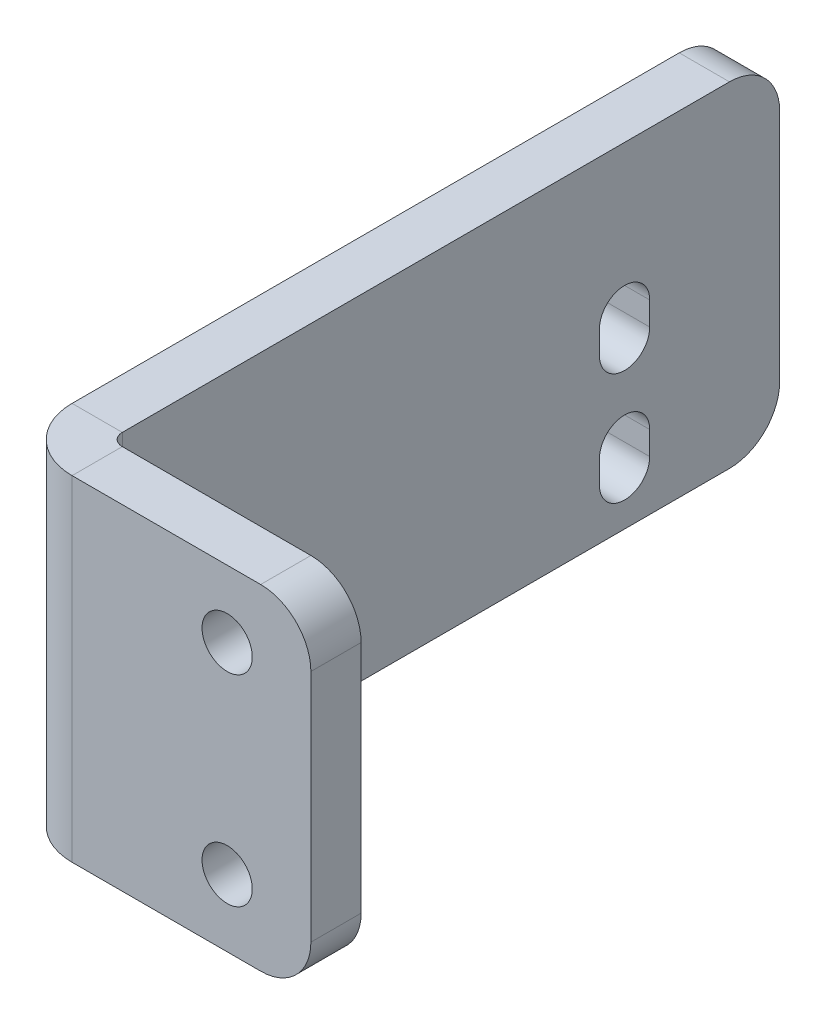
ISO-10303-21;
HEADER;
FILE_DESCRIPTION(('STEP AP214'),'2;1');
FILE_NAME('part.step','',(''),(''),'','','');
FILE_SCHEMA(('AUTOMOTIVE_DESIGN { 1 0 10303 214 1 1 1 1 }'));
ENDSEC;
DATA;
#1=APPLICATION_CONTEXT('core data for automotive mechanical design processes');
#2=APPLICATION_PROTOCOL_DEFINITION('international standard','automotive_design',2000,#1);
#3=PRODUCT_CONTEXT('',#1,'mechanical');
#4=PRODUCT('Part','Part','',(#3));
#5=PRODUCT_RELATED_PRODUCT_CATEGORY('part','',(#4));
#6=PRODUCT_DEFINITION_FORMATION('','',#4);
#7=PRODUCT_DEFINITION_CONTEXT('part definition',#1,'design');
#8=PRODUCT_DEFINITION('design','',#6,#7);
#9=PRODUCT_DEFINITION_SHAPE('','',#8);
#10=(LENGTH_UNIT() NAMED_UNIT(*) SI_UNIT(.MILLI.,.METRE.));
#11=(NAMED_UNIT(*) PLANE_ANGLE_UNIT() SI_UNIT($,.RADIAN.));
#12=(NAMED_UNIT(*) SI_UNIT($,.STERADIAN.) SOLID_ANGLE_UNIT());
#13=UNCERTAINTY_MEASURE_WITH_UNIT(LENGTH_MEASURE(1.E-05),#10,'distance_accuracy_value','');
#14=(GEOMETRIC_REPRESENTATION_CONTEXT(3) GLOBAL_UNCERTAINTY_ASSIGNED_CONTEXT((#13)) GLOBAL_UNIT_ASSIGNED_CONTEXT((#10,
#11,#12)) REPRESENTATION_CONTEXT('',''));
#15=CARTESIAN_POINT('',(0.,0.,0.));
#16=DIRECTION('',(0.,0.,1.));
#17=DIRECTION('',(1.,0.,0.));
#18=AXIS2_PLACEMENT_3D('',#15,#16,#17);
#19=CARTESIAN_POINT('',(-8.60341094882224,20.,-40.3325438161353));
#20=DIRECTION('',(0.,1.,0.));
#21=DIRECTION('',(0.,0.,1.));
#22=AXIS2_PLACEMENT_3D('',#19,#20,#21);
#23=PLANE('',#22);
#24=DIRECTION('',(0.,0.,1.));
#25=VECTOR('',#24,1.);
#26=CARTESIAN_POINT('',(-8.60341094882224,20.,-40.3325438161353));
#27=LINE('',#26,#25);
#28=CARTESIAN_POINT('',(-8.60341094882224,20.,-40.3325438161353));
#29=VERTEX_POINT('',#28);
#30=CARTESIAN_POINT('',(-8.60341094882224,20.,-37.3325438161353));
#31=VERTEX_POINT('',#30);
#32=EDGE_CURVE('E316',#29,#31,#27,.T.);
#33=ORIENTED_EDGE('',*,*,#32,.F.);
#34=CARTESIAN_POINT('',(-8.60341094882224,20.,-41.0691438161353));
#35=DIRECTION('',(0.,-1.,0.));
#36=DIRECTION('',(0.,0.,-1.));
#37=AXIS2_PLACEMENT_3D('',#34,#35,#36);
#38=CIRCLE('',#37,0.7366);
#39=CARTESIAN_POINT('',(-9.34001094882224,20.,-41.0691438161353));
#40=VERTEX_POINT('',#39);
#41=EDGE_CURVE('E260',#40,#29,#38,.F.);
#42=ORIENTED_EDGE('',*,*,#41,.F.);
#43=DIRECTION('',(1.,0.,0.));
#44=VECTOR('',#43,1.);
#45=CARTESIAN_POINT('',(-12.3400109488222,20.,-41.0691438161353));
#46=LINE('',#45,#44);
#47=CARTESIAN_POINT('',(-12.3400109488222,20.,-41.0691438161353));
#48=VERTEX_POINT('',#47);
#49=EDGE_CURVE('E313',#48,#40,#46,.T.);
#50=ORIENTED_EDGE('',*,*,#49,.F.);
#51=CARTESIAN_POINT('',(-8.60341094882224,20.,-41.0691438161353));
#52=DIRECTION('',(0.,1.,0.));
#53=DIRECTION('',(1.,0.,0.));
#54=AXIS2_PLACEMENT_3D('',#51,#52,#53);
#55=CIRCLE('',#54,3.7366);
#56=EDGE_CURVE('E267',#48,#31,#55,.T.);
#57=ORIENTED_EDGE('',*,*,#56,.T.);
#58=EDGE_LOOP('',(#33,#42,#50,#57));
#59=FACE_BOUND('',#58,.T.);
#60=ADVANCED_FACE('F36',(#59),#23,.T.);
#61=CARTESIAN_POINT('',(-12.3400109488222,20.,-41.0691438161353));
#62=DIRECTION('',(0.,1.,0.));
#63=DIRECTION('',(0.,0.,1.));
#64=AXIS2_PLACEMENT_3D('',#61,#62,#63);
#65=PLANE('',#64);
#66=DIRECTION('',(1.,0.,0.));
#67=VECTOR('',#66,1.);
#68=CARTESIAN_POINT('',(-9.34001094882224,20.,-37.3325438161353));
#69=LINE('',#68,#67);
#70=CARTESIAN_POINT('',(2.65998905117776,20.,-37.3325438161353));
#71=VERTEX_POINT('',#70);
#72=EDGE_CURVE('E253',#31,#71,#69,.T.);
#73=ORIENTED_EDGE('',*,*,#72,.T.);
#74=DIRECTION('',(0.,0.,1.));
#75=VECTOR('',#74,1.);
#76=CARTESIAN_POINT('',(2.65998905117776,20.,-41.0691438161353));
#77=LINE('',#76,#75);
#78=CARTESIAN_POINT('',(2.65998905117776,20.,-40.3325438161353));
#79=VERTEX_POINT('',#78);
#80=EDGE_CURVE('E327',#71,#79,#77,.F.);
#81=ORIENTED_EDGE('',*,*,#80,.T.);
#82=DIRECTION('',(1.,0.,0.));
#83=VECTOR('',#82,1.);
#84=CARTESIAN_POINT('',(-9.34001094882224,20.,-40.3325438161353));
#85=LINE('',#84,#83);
#86=EDGE_CURVE('E256',#29,#79,#85,.T.);
#87=ORIENTED_EDGE('',*,*,#86,.F.);
#88=ORIENTED_EDGE('',*,*,#32,.T.);
#89=EDGE_LOOP('',(#73,#81,#87,#88));
#90=FACE_BOUND('',#89,.T.);
#91=ADVANCED_FACE('F391',(#90),#65,.T.);
#92=CARTESIAN_POINT('',(-9.34001094882224,0.,-41.0691438161353));
#93=DIRECTION('',(0.,-1.,0.));
#94=DIRECTION('',(0.,0.,-1.));
#95=AXIS2_PLACEMENT_3D('',#92,#93,#94);
#96=PLANE('',#95);
#97=DIRECTION('',(-1.,0.,0.));
#98=VECTOR('',#97,1.);
#99=CARTESIAN_POINT('',(-9.34001094882224,0.,-41.0691438161353));
#100=LINE('',#99,#98);
#101=CARTESIAN_POINT('',(-9.34001094882224,0.,-41.0691438161353));
#102=VERTEX_POINT('',#101);
#103=CARTESIAN_POINT('',(-12.3400109488222,0.,-41.0691438161353));
#104=VERTEX_POINT('',#103);
#105=EDGE_CURVE('E310',#102,#104,#100,.T.);
#106=ORIENTED_EDGE('',*,*,#105,.F.);
#107=CARTESIAN_POINT('',(-8.60341094882224,0.,-41.0691438161353));
#108=DIRECTION('',(0.,-1.,0.));
#109=DIRECTION('',(0.,0.,-1.));
#110=AXIS2_PLACEMENT_3D('',#107,#108,#109);
#111=CIRCLE('',#110,0.7366);
#112=CARTESIAN_POINT('',(-8.60341094882224,0.,-40.3325438161353));
#113=VERTEX_POINT('',#112);
#114=EDGE_CURVE('E276',#102,#113,#111,.F.);
#115=ORIENTED_EDGE('',*,*,#114,.T.);
#116=DIRECTION('',(0.,0.,-1.));
#117=VECTOR('',#116,1.);
#118=CARTESIAN_POINT('',(-8.60341094882224,0.,-37.3325438161353));
#119=LINE('',#118,#117);
#120=CARTESIAN_POINT('',(-8.60341094882224,0.,-37.3325438161353));
#121=VERTEX_POINT('',#120);
#122=EDGE_CURVE('E308',#121,#113,#119,.T.);
#123=ORIENTED_EDGE('',*,*,#122,.F.);
#124=CARTESIAN_POINT('',(-8.60341094882224,0.,-41.0691438161353));
#125=DIRECTION('',(0.,1.,0.));
#126=DIRECTION('',(1.,0.,0.));
#127=AXIS2_PLACEMENT_3D('',#124,#125,#126);
#128=CIRCLE('',#127,3.7366);
#129=EDGE_CURVE('E257',#104,#121,#128,.T.);
#130=ORIENTED_EDGE('',*,*,#129,.F.);
#131=EDGE_LOOP('',(#106,#115,#123,#130));
#132=FACE_BOUND('',#131,.T.);
#133=ADVANCED_FACE('F411',(#132),#96,.T.);
#134=CARTESIAN_POINT('',(-8.60341094882224,0.,-37.3325438161353));
#135=DIRECTION('',(0.,-1.,0.));
#136=DIRECTION('',(0.,0.,-1.));
#137=AXIS2_PLACEMENT_3D('',#134,#135,#136);
#138=PLANE('',#137);
#139=DIRECTION('',(0.,0.,1.));
#140=VECTOR('',#139,1.);
#141=CARTESIAN_POINT('',(-12.3400109488222,0.,-80.3325438161353));
#142=LINE('',#141,#140);
#143=CARTESIAN_POINT('',(-12.3400109488222,0.,-77.3325438161353));
#144=VERTEX_POINT('',#143);
#145=EDGE_CURVE('E281',#144,#104,#142,.T.);
#146=ORIENTED_EDGE('',*,*,#145,.F.);
#147=DIRECTION('',(1.,0.,0.));
#148=VECTOR('',#147,1.);
#149=CARTESIAN_POINT('',(-8.60341094882224,0.,-77.3325438161353));
#150=LINE('',#149,#148);
#151=CARTESIAN_POINT('',(-9.34001094882224,0.,-77.3325438161353));
#152=VERTEX_POINT('',#151);
#153=EDGE_CURVE('E336',#144,#152,#150,.T.);
#154=ORIENTED_EDGE('',*,*,#153,.T.);
#155=DIRECTION('',(0.,0.,1.));
#156=VECTOR('',#155,1.);
#157=CARTESIAN_POINT('',(-9.34001094882224,0.,-80.3325438161353));
#158=LINE('',#157,#156);
#159=EDGE_CURVE('E279',#152,#102,#158,.T.);
#160=ORIENTED_EDGE('',*,*,#159,.T.);
#161=ORIENTED_EDGE('',*,*,#105,.T.);
#162=EDGE_LOOP('',(#146,#154,#160,#161));
#163=FACE_BOUND('',#162,.T.);
#164=ADVANCED_FACE('F358',(#163),#138,.T.);
#165=CARTESIAN_POINT('',(-9.34001094882224,20.,-37.3325438161353));
#166=DIRECTION('',(0.,0.,-1.));
#167=DIRECTION('',(-1.,0.,0.));
#168=AXIS2_PLACEMENT_3D('',#165,#166,#167);
#169=PLANE('',#168);
#170=CARTESIAN_POINT('',(0.65998905117776,4.,-37.3325438161353));
#171=DIRECTION('',(0.,0.,-1.));
#172=DIRECTION('',(-1.,0.,0.));
#173=AXIS2_PLACEMENT_3D('',#170,#171,#172);
#174=CIRCLE('',#173,1.5);
#175=CARTESIAN_POINT('',(-0.840010948822244,4.,-37.3325438161353));
#176=VERTEX_POINT('',#175);
#177=EDGE_CURVE('E243',#176,#176,#174,.F.);
#178=ORIENTED_EDGE('',*,*,#177,.F.);
#179=EDGE_LOOP('',(#178));
#180=FACE_BOUND('',#179,.T.);
#181=CARTESIAN_POINT('',(0.65998905117776,16.,-37.3325438161353));
#182=DIRECTION('',(0.,0.,-1.));
#183=DIRECTION('',(-1.,0.,0.));
#184=AXIS2_PLACEMENT_3D('',#181,#182,#183);
#185=CIRCLE('',#184,1.5);
#186=CARTESIAN_POINT('',(-0.840010948822244,16.,-37.3325438161353));
#187=VERTEX_POINT('',#186);
#188=EDGE_CURVE('E249',#187,#187,#185,.F.);
#189=ORIENTED_EDGE('',*,*,#188,.F.);
#190=EDGE_LOOP('',(#189));
#191=FACE_BOUND('',#190,.T.);
#192=DIRECTION('',(0.,-1.,0.));
#193=VECTOR('',#192,1.);
#194=CARTESIAN_POINT('',(5.65998905117776,20.,-37.3325438161353));
#195=LINE('',#194,#193);
#196=CARTESIAN_POINT('',(5.65998905117776,17.,-37.3325438161353));
#197=VERTEX_POINT('',#196);
#198=CARTESIAN_POINT('',(5.65998905117776,3.,-37.3325438161353));
#199=VERTEX_POINT('',#198);
#200=EDGE_CURVE('E305',#197,#199,#195,.T.);
#201=ORIENTED_EDGE('',*,*,#200,.F.);
#202=CARTESIAN_POINT('',(2.65998905117776,17.,-37.3325438161353));
#203=DIRECTION('',(0.,0.,-1.));
#204=DIRECTION('',(-1.,0.,0.));
#205=AXIS2_PLACEMENT_3D('',#202,#203,#204);
#206=CIRCLE('',#205,3.);
#207=EDGE_CURVE('E325',#197,#71,#206,.F.);
#208=ORIENTED_EDGE('',*,*,#207,.T.);
#209=ORIENTED_EDGE('',*,*,#72,.F.);
#210=DIRECTION('',(0.,-1.,0.));
#211=VECTOR('',#210,1.);
#212=CARTESIAN_POINT('',(-8.60341094882224,20.,-37.3325438161353));
#213=LINE('',#212,#211);
#214=EDGE_CURVE('E270',#31,#121,#213,.T.);
#215=ORIENTED_EDGE('',*,*,#214,.T.);
#216=DIRECTION('',(1.,0.,0.));
#217=VECTOR('',#216,1.);
#218=CARTESIAN_POINT('',(-9.34001094882224,0.,-37.3325438161353));
#219=LINE('',#218,#217);
#220=CARTESIAN_POINT('',(2.65998905117776,0.,-37.3325438161353));
#221=VERTEX_POINT('',#220);
#222=EDGE_CURVE('E252',#121,#221,#219,.T.);
#223=ORIENTED_EDGE('',*,*,#222,.T.);
#224=CARTESIAN_POINT('',(2.65998905117776,3.,-37.3325438161353));
#225=DIRECTION('',(0.,0.,-1.));
#226=DIRECTION('',(-1.,0.,0.));
#227=AXIS2_PLACEMENT_3D('',#224,#225,#226);
#228=CIRCLE('',#227,3.);
#229=EDGE_CURVE('E323',#221,#199,#228,.F.);
#230=ORIENTED_EDGE('',*,*,#229,.T.);
#231=EDGE_LOOP('',(#201,#208,#209,#215,#223,#230));
#232=FACE_BOUND('',#231,.T.);
#233=ADVANCED_FACE('F415',(#180,#191,#232),#169,.F.);
#234=CARTESIAN_POINT('',(5.65998905117776,20.,-40.3325438161353));
#235=DIRECTION('',(1.,0.,0.));
#236=DIRECTION('',(0.,0.,-1.));
#237=AXIS2_PLACEMENT_3D('',#234,#235,#236);
#238=PLANE('',#237);
#239=DIRECTION('',(0.,-1.,0.));
#240=VECTOR('',#239,1.);
#241=CARTESIAN_POINT('',(5.65998905117776,20.,-40.3325438161353));
#242=LINE('',#241,#240);
#243=CARTESIAN_POINT('',(5.65998905117776,17.,-40.3325438161353));
#244=VERTEX_POINT('',#243);
#245=CARTESIAN_POINT('',(5.65998905117776,3.,-40.3325438161353));
#246=VERTEX_POINT('',#245);
#247=EDGE_CURVE('E302',#244,#246,#242,.T.);
#248=ORIENTED_EDGE('',*,*,#247,.F.);
#249=DIRECTION('',(0.,0.,1.));
#250=VECTOR('',#249,1.);
#251=CARTESIAN_POINT('',(5.65998905117776,17.,-40.3325438161353));
#252=LINE('',#251,#250);
#253=EDGE_CURVE('E320',#244,#197,#252,.T.);
#254=ORIENTED_EDGE('',*,*,#253,.T.);
#255=ORIENTED_EDGE('',*,*,#200,.T.);
#256=DIRECTION('',(0.,0.,1.));
#257=VECTOR('',#256,1.);
#258=CARTESIAN_POINT('',(5.65998905117776,3.,-40.3325438161353));
#259=LINE('',#258,#257);
#260=EDGE_CURVE('E318',#199,#246,#259,.F.);
#261=ORIENTED_EDGE('',*,*,#260,.T.);
#262=EDGE_LOOP('',(#248,#254,#255,#261));
#263=FACE_BOUND('',#262,.T.);
#264=ADVANCED_FACE('F400',(#263),#238,.T.);
#265=CARTESIAN_POINT('',(-9.34001094882224,20.,-40.3325438161353));
#266=DIRECTION('',(0.,0.,-1.));
#267=DIRECTION('',(-1.,0.,0.));
#268=AXIS2_PLACEMENT_3D('',#265,#266,#267);
#269=PLANE('',#268);
#270=CARTESIAN_POINT('',(0.65998905117776,4.,-40.3325438161353));
#271=DIRECTION('',(0.,0.,-1.));
#272=DIRECTION('',(-1.,0.,0.));
#273=AXIS2_PLACEMENT_3D('',#270,#271,#272);
#274=CIRCLE('',#273,1.5);
#275=CARTESIAN_POINT('',(-0.840010948822244,4.,-40.3325438161353));
#276=VERTEX_POINT('',#275);
#277=EDGE_CURVE('E234',#276,#276,#274,.T.);
#278=ORIENTED_EDGE('',*,*,#277,.F.);
#279=EDGE_LOOP('',(#278));
#280=FACE_BOUND('',#279,.T.);
#281=CARTESIAN_POINT('',(0.65998905117776,16.,-40.3325438161353));
#282=DIRECTION('',(0.,0.,-1.));
#283=DIRECTION('',(-1.,0.,0.));
#284=AXIS2_PLACEMENT_3D('',#281,#282,#283);
#285=CIRCLE('',#284,1.5);
#286=CARTESIAN_POINT('',(-0.840010948822244,16.,-40.3325438161353));
#287=VERTEX_POINT('',#286);
#288=EDGE_CURVE('E246',#287,#287,#285,.T.);
#289=ORIENTED_EDGE('',*,*,#288,.F.);
#290=EDGE_LOOP('',(#289));
#291=FACE_BOUND('',#290,.T.);
#292=ORIENTED_EDGE('',*,*,#86,.T.);
#293=CARTESIAN_POINT('',(2.65998905117776,17.,-40.3325438161353));
#294=DIRECTION('',(0.,0.,-1.));
#295=DIRECTION('',(-1.,0.,0.));
#296=AXIS2_PLACEMENT_3D('',#293,#294,#295);
#297=CIRCLE('',#296,3.);
#298=EDGE_CURVE('E331',#79,#244,#297,.T.);
#299=ORIENTED_EDGE('',*,*,#298,.T.);
#300=ORIENTED_EDGE('',*,*,#247,.T.);
#301=CARTESIAN_POINT('',(2.65998905117776,3.,-40.3325438161353));
#302=DIRECTION('',(0.,0.,-1.));
#303=DIRECTION('',(-1.,0.,0.));
#304=AXIS2_PLACEMENT_3D('',#301,#302,#303);
#305=CIRCLE('',#304,3.);
#306=CARTESIAN_POINT('',(2.65998905117776,0.,-40.3325438161353));
#307=VERTEX_POINT('',#306);
#308=EDGE_CURVE('E329',#246,#307,#305,.T.);
#309=ORIENTED_EDGE('',*,*,#308,.T.);
#310=DIRECTION('',(1.,0.,0.));
#311=VECTOR('',#310,1.);
#312=CARTESIAN_POINT('',(-9.34001094882224,0.,-40.3325438161353));
#313=LINE('',#312,#311);
#314=EDGE_CURVE('E273',#113,#307,#313,.T.);
#315=ORIENTED_EDGE('',*,*,#314,.F.);
#316=DIRECTION('',(0.,-1.,0.));
#317=VECTOR('',#316,1.);
#318=CARTESIAN_POINT('',(-8.60341094882224,20.,-40.3325438161353));
#319=LINE('',#318,#317);
#320=EDGE_CURVE('E299',#29,#113,#319,.T.);
#321=ORIENTED_EDGE('',*,*,#320,.F.);
#322=EDGE_LOOP('',(#292,#299,#300,#309,#315,#321));
#323=FACE_BOUND('',#322,.T.);
#324=ADVANCED_FACE('F389',(#280,#291,#323),#269,.T.);
#325=CARTESIAN_POINT('',(-8.60341094882224,20.,-41.0691438161353));
#326=DIRECTION('',(0.,-1.,0.));
#327=DIRECTION('',(0.,0.,-1.));
#328=AXIS2_PLACEMENT_3D('',#325,#326,#327);
#329=CYLINDRICAL_SURFACE('',#328,0.7366);
#330=ORIENTED_EDGE('',*,*,#114,.F.);
#331=DIRECTION('',(0.,-1.,0.));
#332=VECTOR('',#331,1.);
#333=CARTESIAN_POINT('',(-9.34001094882224,20.,-41.0691438161353));
#334=LINE('',#333,#332);
#335=EDGE_CURVE('E296',#40,#102,#334,.T.);
#336=ORIENTED_EDGE('',*,*,#335,.F.);
#337=ORIENTED_EDGE('',*,*,#41,.T.);
#338=ORIENTED_EDGE('',*,*,#320,.T.);
#339=EDGE_LOOP('',(#330,#336,#337,#338));
#340=FACE_BOUND('',#339,.T.);
#341=ADVANCED_FACE('F381',(#340),#329,.F.);
#342=CARTESIAN_POINT('',(-9.34001094882224,20.,-80.3325438161353));
#343=DIRECTION('',(1.,0.,0.));
#344=DIRECTION('',(0.,0.,-1.));
#345=AXIS2_PLACEMENT_3D('',#342,#343,#344);
#346=PLANE('',#345);
#347=CARTESIAN_POINT('',(-9.34001094882224,4.4,-71.0691438161354));
#348=DIRECTION('',(1.,0.,0.));
#349=DIRECTION('',(0.,0.,-1.));
#350=AXIS2_PLACEMENT_3D('',#347,#348,#349);
#351=CIRCLE('',#350,1.5);
#352=CARTESIAN_POINT('',(-9.34001094882224,4.4,-72.5691438161354));
#353=VERTEX_POINT('',#352);
#354=CARTESIAN_POINT('',(-9.34001094882224,4.4,-69.5691438161354));
#355=VERTEX_POINT('',#354);
#356=EDGE_CURVE('E51',#353,#355,#351,.T.);
#357=ORIENTED_EDGE('',*,*,#356,.F.);
#358=DIRECTION('',(0.,1.,0.));
#359=VECTOR('',#358,1.);
#360=CARTESIAN_POINT('',(-9.34001094882224,4.4,-72.5691438161354));
#361=LINE('',#360,#359);
#362=CARTESIAN_POINT('',(-9.34001094882224,3.,-72.5691438161354));
#363=VERTEX_POINT('',#362);
#364=EDGE_CURVE('E190',#363,#353,#361,.T.);
#365=ORIENTED_EDGE('',*,*,#364,.F.);
#366=CARTESIAN_POINT('',(-9.34001094882224,3.,-71.0691438161354));
#367=DIRECTION('',(1.,0.,0.));
#368=DIRECTION('',(0.,0.,-1.));
#369=AXIS2_PLACEMENT_3D('',#366,#367,#368);
#370=CIRCLE('',#369,1.5);
#371=CARTESIAN_POINT('',(-9.34001094882224,3.,-69.5691438161354));
#372=VERTEX_POINT('',#371);
#373=EDGE_CURVE('E193',#372,#363,#370,.T.);
#374=ORIENTED_EDGE('',*,*,#373,.F.);
#375=DIRECTION('',(0.,-1.,0.));
#376=VECTOR('',#375,1.);
#377=CARTESIAN_POINT('',(-9.34001094882224,4.4,-69.5691438161354));
#378=LINE('',#377,#376);
#379=EDGE_CURVE('E199',#355,#372,#378,.T.);
#380=ORIENTED_EDGE('',*,*,#379,.F.);
#381=EDGE_LOOP('',(#357,#365,#374,#380));
#382=FACE_BOUND('',#381,.T.);
#383=CARTESIAN_POINT('',(-9.34001094882224,11.1,-71.0691438161354));
#384=DIRECTION('',(1.,0.,0.));
#385=DIRECTION('',(0.,0.,-1.));
#386=AXIS2_PLACEMENT_3D('',#383,#384,#385);
#387=CIRCLE('',#386,1.50000000000003);
#388=CARTESIAN_POINT('',(-9.34001094882224,11.1,-72.5691438161354));
#389=VERTEX_POINT('',#388);
#390=CARTESIAN_POINT('',(-9.34001094882224,11.1,-69.5691438161354));
#391=VERTEX_POINT('',#390);
#392=EDGE_CURVE('E205',#389,#391,#387,.T.);
#393=ORIENTED_EDGE('',*,*,#392,.F.);
#394=DIRECTION('',(0.,1.,0.));
#395=VECTOR('',#394,1.);
#396=CARTESIAN_POINT('',(-9.34001094882224,11.1,-72.5691438161354));
#397=LINE('',#396,#395);
#398=CARTESIAN_POINT('',(-9.34001094882224,9.7,-72.5691438161354));
#399=VERTEX_POINT('',#398);
#400=EDGE_CURVE('E213',#399,#389,#397,.T.);
#401=ORIENTED_EDGE('',*,*,#400,.F.);
#402=CARTESIAN_POINT('',(-9.34001094882224,9.7,-71.0691438161354));
#403=DIRECTION('',(1.,0.,0.));
#404=DIRECTION('',(0.,0.,-1.));
#405=AXIS2_PLACEMENT_3D('',#402,#403,#404);
#406=CIRCLE('',#405,1.50000000000003);
#407=CARTESIAN_POINT('',(-9.34001094882224,9.7,-69.5691438161354));
#408=VERTEX_POINT('',#407);
#409=EDGE_CURVE('E227',#408,#399,#406,.T.);
#410=ORIENTED_EDGE('',*,*,#409,.F.);
#411=DIRECTION('',(0.,-1.,0.));
#412=VECTOR('',#411,1.);
#413=CARTESIAN_POINT('',(-9.34001094882224,11.1,-69.5691438161354));
#414=LINE('',#413,#412);
#415=EDGE_CURVE('E224',#391,#408,#414,.T.);
#416=ORIENTED_EDGE('',*,*,#415,.F.);
#417=EDGE_LOOP('',(#393,#401,#410,#416));
#418=FACE_BOUND('',#417,.T.);
#419=ORIENTED_EDGE('',*,*,#159,.F.);
#420=CARTESIAN_POINT('',(-9.34001094882224,3.,-77.3325438161353));
#421=DIRECTION('',(1.,0.,0.));
#422=DIRECTION('',(0.,0.,-1.));
#423=AXIS2_PLACEMENT_3D('',#420,#421,#422);
#424=CIRCLE('',#423,3.);
#425=CARTESIAN_POINT('',(-9.34001094882224,3.,-80.3325438161353));
#426=VERTEX_POINT('',#425);
#427=EDGE_CURVE('E341',#152,#426,#424,.T.);
#428=ORIENTED_EDGE('',*,*,#427,.T.);
#429=DIRECTION('',(0.,-1.,0.));
#430=VECTOR('',#429,1.);
#431=CARTESIAN_POINT('',(-9.34001094882224,20.,-80.3325438161353));
#432=LINE('',#431,#430);
#433=CARTESIAN_POINT('',(-9.34001094882224,17.,-80.3325438161353));
#434=VERTEX_POINT('',#433);
#435=EDGE_CURVE('E293',#434,#426,#432,.T.);
#436=ORIENTED_EDGE('',*,*,#435,.F.);
#437=CARTESIAN_POINT('',(-9.34001094882224,17.,-77.3325438161353));
#438=DIRECTION('',(1.,0.,0.));
#439=DIRECTION('',(0.,0.,-1.));
#440=AXIS2_PLACEMENT_3D('',#437,#438,#439);
#441=CIRCLE('',#440,3.);
#442=CARTESIAN_POINT('',(-9.34001094882224,20.,-77.3325438161353));
#443=VERTEX_POINT('',#442);
#444=EDGE_CURVE('E339',#434,#443,#441,.T.);
#445=ORIENTED_EDGE('',*,*,#444,.T.);
#446=DIRECTION('',(0.,0.,1.));
#447=VECTOR('',#446,1.);
#448=CARTESIAN_POINT('',(-9.34001094882224,20.,-80.3325438161353));
#449=LINE('',#448,#447);
#450=EDGE_CURVE('E263',#443,#40,#449,.T.);
#451=ORIENTED_EDGE('',*,*,#450,.T.);
#452=ORIENTED_EDGE('',*,*,#335,.T.);
#453=EDGE_LOOP('',(#419,#428,#436,#445,#451,#452));
#454=FACE_BOUND('',#453,.T.);
#455=ADVANCED_FACE('F364',(#382,#418,#454),#346,.T.);
#456=CARTESIAN_POINT('',(-12.3400109488222,20.,-80.3325438161353));
#457=DIRECTION('',(0.,0.,-1.));
#458=DIRECTION('',(-1.,0.,0.));
#459=AXIS2_PLACEMENT_3D('',#456,#457,#458);
#460=PLANE('',#459);
#461=ORIENTED_EDGE('',*,*,#435,.T.);
#462=DIRECTION('',(1.,0.,0.));
#463=VECTOR('',#462,1.);
#464=CARTESIAN_POINT('',(-12.3400109488222,3.,-80.3325438161353));
#465=LINE('',#464,#463);
#466=CARTESIAN_POINT('',(-12.3400109488222,3.,-80.3325438161353));
#467=VERTEX_POINT('',#466);
#468=EDGE_CURVE('E346',#426,#467,#465,.F.);
#469=ORIENTED_EDGE('',*,*,#468,.T.);
#470=DIRECTION('',(0.,-1.,0.));
#471=VECTOR('',#470,1.);
#472=CARTESIAN_POINT('',(-12.3400109488222,20.,-80.3325438161353));
#473=LINE('',#472,#471);
#474=CARTESIAN_POINT('',(-12.3400109488222,17.,-80.3325438161353));
#475=VERTEX_POINT('',#474);
#476=EDGE_CURVE('E290',#475,#467,#473,.T.);
#477=ORIENTED_EDGE('',*,*,#476,.F.);
#478=DIRECTION('',(1.,0.,0.));
#479=VECTOR('',#478,1.);
#480=CARTESIAN_POINT('',(-9.34001094882224,17.,-80.3325438161353));
#481=LINE('',#480,#479);
#482=EDGE_CURVE('E343',#475,#434,#481,.T.);
#483=ORIENTED_EDGE('',*,*,#482,.T.);
#484=EDGE_LOOP('',(#461,#469,#477,#483));
#485=FACE_BOUND('',#484,.T.);
#486=ADVANCED_FACE('F366',(#485),#460,.T.);
#487=CARTESIAN_POINT('',(-12.3400109488222,20.,-80.3325438161353));
#488=DIRECTION('',(1.,0.,0.));
#489=DIRECTION('',(0.,0.,-1.));
#490=AXIS2_PLACEMENT_3D('',#487,#488,#489);
#491=PLANE('',#490);
#492=DIRECTION('',(0.,1.,0.));
#493=VECTOR('',#492,1.);
#494=CARTESIAN_POINT('',(-12.3400109488222,4.4,-72.5691438161354));
#495=LINE('',#494,#493);
#496=CARTESIAN_POINT('',(-12.3400109488222,3.,-72.5691438161354));
#497=VERTEX_POINT('',#496);
#498=CARTESIAN_POINT('',(-12.3400109488222,4.4,-72.5691438161354));
#499=VERTEX_POINT('',#498);
#500=EDGE_CURVE('E180',#497,#499,#495,.T.);
#501=ORIENTED_EDGE('',*,*,#500,.T.);
#502=CARTESIAN_POINT('',(-12.3400109488222,4.4,-71.0691438161354));
#503=DIRECTION('',(1.,0.,0.));
#504=DIRECTION('',(0.,0.,-1.));
#505=AXIS2_PLACEMENT_3D('',#502,#503,#504);
#506=CIRCLE('',#505,1.5);
#507=CARTESIAN_POINT('',(-12.3400109488222,4.4,-69.5691438161354));
#508=VERTEX_POINT('',#507);
#509=EDGE_CURVE('E174',#499,#508,#506,.T.);
#510=ORIENTED_EDGE('',*,*,#509,.T.);
#511=DIRECTION('',(0.,-1.,0.));
#512=VECTOR('',#511,1.);
#513=CARTESIAN_POINT('',(-12.3400109488222,4.4,-69.5691438161354));
#514=LINE('',#513,#512);
#515=CARTESIAN_POINT('',(-12.3400109488222,3.,-69.5691438161354));
#516=VERTEX_POINT('',#515);
#517=EDGE_CURVE('E183',#508,#516,#514,.T.);
#518=ORIENTED_EDGE('',*,*,#517,.T.);
#519=CARTESIAN_POINT('',(-12.3400109488222,3.,-71.0691438161354));
#520=DIRECTION('',(1.,0.,0.));
#521=DIRECTION('',(0.,0.,-1.));
#522=AXIS2_PLACEMENT_3D('',#519,#520,#521);
#523=CIRCLE('',#522,1.5);
#524=EDGE_CURVE('E59',#516,#497,#523,.T.);
#525=ORIENTED_EDGE('',*,*,#524,.T.);
#526=EDGE_LOOP('',(#501,#510,#518,#525));
#527=FACE_BOUND('',#526,.T.);
#528=DIRECTION('',(0.,1.,0.));
#529=VECTOR('',#528,1.);
#530=CARTESIAN_POINT('',(-12.3400109488222,11.1,-72.5691438161354));
#531=LINE('',#530,#529);
#532=CARTESIAN_POINT('',(-12.3400109488222,9.7,-72.5691438161354));
#533=VERTEX_POINT('',#532);
#534=CARTESIAN_POINT('',(-12.3400109488222,11.1,-72.5691438161354));
#535=VERTEX_POINT('',#534);
#536=EDGE_CURVE('E219',#533,#535,#531,.T.);
#537=ORIENTED_EDGE('',*,*,#536,.T.);
#538=CARTESIAN_POINT('',(-12.3400109488222,11.1,-71.0691438161354));
#539=DIRECTION('',(1.,0.,0.));
#540=DIRECTION('',(0.,0.,-1.));
#541=AXIS2_PLACEMENT_3D('',#538,#539,#540);
#542=CIRCLE('',#541,1.50000000000003);
#543=CARTESIAN_POINT('',(-12.3400109488222,11.1,-69.5691438161354));
#544=VERTEX_POINT('',#543);
#545=EDGE_CURVE('E209',#535,#544,#542,.T.);
#546=ORIENTED_EDGE('',*,*,#545,.T.);
#547=DIRECTION('',(0.,-1.,0.));
#548=VECTOR('',#547,1.);
#549=CARTESIAN_POINT('',(-12.3400109488222,11.1,-69.5691438161354));
#550=LINE('',#549,#548);
#551=CARTESIAN_POINT('',(-12.3400109488222,9.7,-69.5691438161354));
#552=VERTEX_POINT('',#551);
#553=EDGE_CURVE('E212',#544,#552,#550,.T.);
#554=ORIENTED_EDGE('',*,*,#553,.T.);
#555=CARTESIAN_POINT('',(-12.3400109488222,9.7,-71.0691438161354));
#556=DIRECTION('',(1.,0.,0.));
#557=DIRECTION('',(0.,0.,-1.));
#558=AXIS2_PLACEMENT_3D('',#555,#556,#557);
#559=CIRCLE('',#558,1.50000000000003);
#560=EDGE_CURVE('E216',#552,#533,#559,.T.);
#561=ORIENTED_EDGE('',*,*,#560,.T.);
#562=EDGE_LOOP('',(#537,#546,#554,#561));
#563=FACE_BOUND('',#562,.T.);
#564=ORIENTED_EDGE('',*,*,#476,.T.);
#565=CARTESIAN_POINT('',(-12.3400109488222,3.,-77.3325438161353));
#566=DIRECTION('',(1.,0.,0.));
#567=DIRECTION('',(0.,0.,-1.));
#568=AXIS2_PLACEMENT_3D('',#565,#566,#567);
#569=CIRCLE('',#568,3.);
#570=EDGE_CURVE('E44',#467,#144,#569,.F.);
#571=ORIENTED_EDGE('',*,*,#570,.T.);
#572=ORIENTED_EDGE('',*,*,#145,.T.);
#573=DIRECTION('',(0.,-1.,0.));
#574=VECTOR('',#573,1.);
#575=CARTESIAN_POINT('',(-12.3400109488222,20.,-41.0691438161353));
#576=LINE('',#575,#574);
#577=EDGE_CURVE('E287',#48,#104,#576,.T.);
#578=ORIENTED_EDGE('',*,*,#577,.F.);
#579=DIRECTION('',(0.,0.,1.));
#580=VECTOR('',#579,1.);
#581=CARTESIAN_POINT('',(-12.3400109488222,20.,-80.3325438161353));
#582=LINE('',#581,#580);
#583=CARTESIAN_POINT('',(-12.3400109488222,20.,-77.3325438161353));
#584=VERTEX_POINT('',#583);
#585=EDGE_CURVE('E265',#584,#48,#582,.T.);
#586=ORIENTED_EDGE('',*,*,#585,.F.);
#587=CARTESIAN_POINT('',(-12.3400109488222,17.,-77.3325438161353));
#588=DIRECTION('',(1.,0.,0.));
#589=DIRECTION('',(0.,0.,-1.));
#590=AXIS2_PLACEMENT_3D('',#587,#588,#589);
#591=CIRCLE('',#590,3.);
#592=EDGE_CURVE('E348',#584,#475,#591,.F.);
#593=ORIENTED_EDGE('',*,*,#592,.T.);
#594=EDGE_LOOP('',(#564,#571,#572,#578,#586,#593));
#595=FACE_BOUND('',#594,.T.);
#596=ADVANCED_FACE('F187',(#527,#563,#595),#491,.F.);
#597=CARTESIAN_POINT('',(-8.60341094882224,20.,-41.0691438161353));
#598=DIRECTION('',(0.,-1.,0.));
#599=DIRECTION('',(0.,0.,-1.));
#600=AXIS2_PLACEMENT_3D('',#597,#598,#599);
#601=CYLINDRICAL_SURFACE('',#600,3.7366);
#602=ORIENTED_EDGE('',*,*,#129,.T.);
#603=ORIENTED_EDGE('',*,*,#214,.F.);
#604=ORIENTED_EDGE('',*,*,#56,.F.);
#605=ORIENTED_EDGE('',*,*,#577,.T.);
#606=EDGE_LOOP('',(#602,#603,#604,#605));
#607=FACE_BOUND('',#606,.T.);
#608=ADVANCED_FACE('F413',(#607),#601,.T.);
#609=CARTESIAN_POINT('',(-8.60341094882224,20.,-41.0691438161353));
#610=DIRECTION('',(0.,-1.,0.));
#611=DIRECTION('',(-1.,0.,0.));
#612=AXIS2_PLACEMENT_3D('',#609,#610,#611);
#613=PLANE('',#612);
#614=ORIENTED_EDGE('',*,*,#450,.F.);
#615=DIRECTION('',(1.,0.,0.));
#616=VECTOR('',#615,1.);
#617=CARTESIAN_POINT('',(-12.3400109488222,20.,-77.3325438161353));
#618=LINE('',#617,#616);
#619=EDGE_CURVE('E11',#443,#584,#618,.F.);
#620=ORIENTED_EDGE('',*,*,#619,.T.);
#621=ORIENTED_EDGE('',*,*,#585,.T.);
#622=ORIENTED_EDGE('',*,*,#49,.T.);
#623=EDGE_LOOP('',(#614,#620,#621,#622));
#624=FACE_BOUND('',#623,.T.);
#625=ADVANCED_FACE('F373',(#624),#613,.F.);
#626=CARTESIAN_POINT('',(-8.60341094882224,0.,-41.0691438161353));
#627=DIRECTION('',(0.,-1.,0.));
#628=DIRECTION('',(-1.,0.,0.));
#629=AXIS2_PLACEMENT_3D('',#626,#627,#628);
#630=PLANE('',#629);
#631=ORIENTED_EDGE('',*,*,#314,.T.);
#632=DIRECTION('',(0.,0.,1.));
#633=VECTOR('',#632,1.);
#634=CARTESIAN_POINT('',(2.65998905117776,0.,-41.0691438161353));
#635=LINE('',#634,#633);
#636=EDGE_CURVE('E333',#307,#221,#635,.T.);
#637=ORIENTED_EDGE('',*,*,#636,.T.);
#638=ORIENTED_EDGE('',*,*,#222,.F.);
#639=ORIENTED_EDGE('',*,*,#122,.T.);
#640=EDGE_LOOP('',(#631,#637,#638,#639));
#641=FACE_BOUND('',#640,.T.);
#642=ADVANCED_FACE('F407',(#641),#630,.T.);
#643=CARTESIAN_POINT('',(0.65998905117776,16.,-37.3315438161353));
#644=DIRECTION('',(0.,0.,-1.));
#645=DIRECTION('',(-1.,0.,0.));
#646=AXIS2_PLACEMENT_3D('',#643,#644,#645);
#647=CYLINDRICAL_SURFACE('',#646,1.5);
#648=ORIENTED_EDGE('',*,*,#288,.T.);
#649=EDGE_LOOP('',(#648));
#650=FACE_BOUND('',#649,.T.);
#651=ORIENTED_EDGE('',*,*,#188,.T.);
#652=EDGE_LOOP('',(#651));
#653=FACE_BOUND('',#652,.T.);
#654=ADVANCED_FACE('F462',(#650,#653),#647,.F.);
#655=CARTESIAN_POINT('',(0.65998905117776,4.,-37.3315438161353));
#656=DIRECTION('',(0.,0.,-1.));
#657=DIRECTION('',(-1.,0.,0.));
#658=AXIS2_PLACEMENT_3D('',#655,#656,#657);
#659=CYLINDRICAL_SURFACE('',#658,1.5);
#660=ORIENTED_EDGE('',*,*,#277,.T.);
#661=EDGE_LOOP('',(#660));
#662=FACE_BOUND('',#661,.T.);
#663=ORIENTED_EDGE('',*,*,#177,.T.);
#664=EDGE_LOOP('',(#663));
#665=FACE_BOUND('',#664,.T.);
#666=ADVANCED_FACE('F437',(#662,#665),#659,.F.);
#667=CARTESIAN_POINT('',(2.65998905117776,17.,-40.3325438161353));
#668=DIRECTION('',(0.,0.,1.));
#669=DIRECTION('',(1.,0.,0.));
#670=AXIS2_PLACEMENT_3D('',#667,#668,#669);
#671=CYLINDRICAL_SURFACE('',#670,3.);
#672=ORIENTED_EDGE('',*,*,#298,.F.);
#673=ORIENTED_EDGE('',*,*,#80,.F.);
#674=ORIENTED_EDGE('',*,*,#207,.F.);
#675=ORIENTED_EDGE('',*,*,#253,.F.);
#676=EDGE_LOOP('',(#672,#673,#674,#675));
#677=FACE_BOUND('',#676,.T.);
#678=ADVANCED_FACE('F395',(#677),#671,.T.);
#679=CARTESIAN_POINT('',(2.65998905117776,3.,-41.0691438161353));
#680=DIRECTION('',(0.,0.,1.));
#681=DIRECTION('',(1.,0.,0.));
#682=AXIS2_PLACEMENT_3D('',#679,#680,#681);
#683=CYLINDRICAL_SURFACE('',#682,3.);
#684=ORIENTED_EDGE('',*,*,#308,.F.);
#685=ORIENTED_EDGE('',*,*,#260,.F.);
#686=ORIENTED_EDGE('',*,*,#229,.F.);
#687=ORIENTED_EDGE('',*,*,#636,.F.);
#688=EDGE_LOOP('',(#684,#685,#686,#687));
#689=FACE_BOUND('',#688,.T.);
#690=ADVANCED_FACE('F404',(#689),#683,.T.);
#691=CARTESIAN_POINT('',(-8.60341094882224,3.,-77.3325438161353));
#692=DIRECTION('',(1.,0.,0.));
#693=DIRECTION('',(0.,0.,-1.));
#694=AXIS2_PLACEMENT_3D('',#691,#692,#693);
#695=CYLINDRICAL_SURFACE('',#694,3.);
#696=ORIENTED_EDGE('',*,*,#570,.F.);
#697=ORIENTED_EDGE('',*,*,#468,.F.);
#698=ORIENTED_EDGE('',*,*,#427,.F.);
#699=ORIENTED_EDGE('',*,*,#153,.F.);
#700=EDGE_LOOP('',(#696,#697,#698,#699));
#701=FACE_BOUND('',#700,.T.);
#702=ADVANCED_FACE('F361',(#701),#695,.T.);
#703=CARTESIAN_POINT('',(-12.3400109488222,17.,-77.3325438161353));
#704=DIRECTION('',(-1.,0.,0.));
#705=DIRECTION('',(0.,0.,1.));
#706=AXIS2_PLACEMENT_3D('',#703,#704,#705);
#707=CYLINDRICAL_SURFACE('',#706,3.);
#708=ORIENTED_EDGE('',*,*,#592,.F.);
#709=ORIENTED_EDGE('',*,*,#619,.F.);
#710=ORIENTED_EDGE('',*,*,#444,.F.);
#711=ORIENTED_EDGE('',*,*,#482,.F.);
#712=EDGE_LOOP('',(#708,#709,#710,#711));
#713=FACE_BOUND('',#712,.T.);
#714=ADVANCED_FACE('F38',(#713),#707,.T.);
#715=CARTESIAN_POINT('',(-12.3400109488222,11.1,-71.0691438161354));
#716=DIRECTION('',(1.,0.,0.));
#717=DIRECTION('',(0.,0.,-1.));
#718=AXIS2_PLACEMENT_3D('',#715,#716,#717);
#719=CYLINDRICAL_SURFACE('',#718,1.50000000000003);
#720=ORIENTED_EDGE('',*,*,#392,.T.);
#721=DIRECTION('',(1.,0.,0.));
#722=VECTOR('',#721,1.);
#723=CARTESIAN_POINT('',(-12.3400109488222,11.1,-69.5691438161354));
#724=LINE('',#723,#722);
#725=EDGE_CURVE('E222',#544,#391,#724,.T.);
#726=ORIENTED_EDGE('',*,*,#725,.F.);
#727=ORIENTED_EDGE('',*,*,#545,.F.);
#728=DIRECTION('',(1.,0.,0.));
#729=VECTOR('',#728,1.);
#730=CARTESIAN_POINT('',(-12.3400109488222,11.1,-72.5691438161354));
#731=LINE('',#730,#729);
#732=EDGE_CURVE('E232',#535,#389,#731,.T.);
#733=ORIENTED_EDGE('',*,*,#732,.T.);
#734=EDGE_LOOP('',(#720,#726,#727,#733));
#735=FACE_BOUND('',#734,.T.);
#736=ADVANCED_FACE('F443',(#735),#719,.F.);
#737=CARTESIAN_POINT('',(-12.3400109488222,11.1,-72.5691438161354));
#738=DIRECTION('',(0.,0.,-1.));
#739=DIRECTION('',(-1.,0.,0.));
#740=AXIS2_PLACEMENT_3D('',#737,#738,#739);
#741=PLANE('',#740);
#742=ORIENTED_EDGE('',*,*,#400,.T.);
#743=ORIENTED_EDGE('',*,*,#732,.F.);
#744=ORIENTED_EDGE('',*,*,#536,.F.);
#745=DIRECTION('',(1.,0.,0.));
#746=VECTOR('',#745,1.);
#747=CARTESIAN_POINT('',(-12.3400109488222,9.7,-72.5691438161354));
#748=LINE('',#747,#746);
#749=EDGE_CURVE('E235',#533,#399,#748,.T.);
#750=ORIENTED_EDGE('',*,*,#749,.T.);
#751=EDGE_LOOP('',(#742,#743,#744,#750));
#752=FACE_BOUND('',#751,.T.);
#753=ADVANCED_FACE('F447',(#752),#741,.F.);
#754=CARTESIAN_POINT('',(-12.3400109488222,9.7,-71.0691438161354));
#755=DIRECTION('',(1.,0.,0.));
#756=DIRECTION('',(0.,0.,-1.));
#757=AXIS2_PLACEMENT_3D('',#754,#755,#756);
#758=CYLINDRICAL_SURFACE('',#757,1.50000000000003);
#759=ORIENTED_EDGE('',*,*,#409,.T.);
#760=ORIENTED_EDGE('',*,*,#749,.F.);
#761=ORIENTED_EDGE('',*,*,#560,.F.);
#762=DIRECTION('',(1.,0.,0.));
#763=VECTOR('',#762,1.);
#764=CARTESIAN_POINT('',(-12.3400109488222,9.7,-69.5691438161354));
#765=LINE('',#764,#763);
#766=EDGE_CURVE('E237',#552,#408,#765,.T.);
#767=ORIENTED_EDGE('',*,*,#766,.T.);
#768=EDGE_LOOP('',(#759,#760,#761,#767));
#769=FACE_BOUND('',#768,.T.);
#770=ADVANCED_FACE('F453',(#769),#758,.F.);
#771=CARTESIAN_POINT('',(-12.3400109488222,11.1,-69.5691438161354));
#772=DIRECTION('',(0.,0.,1.));
#773=DIRECTION('',(1.,0.,0.));
#774=AXIS2_PLACEMENT_3D('',#771,#772,#773);
#775=PLANE('',#774);
#776=ORIENTED_EDGE('',*,*,#415,.T.);
#777=ORIENTED_EDGE('',*,*,#766,.F.);
#778=ORIENTED_EDGE('',*,*,#553,.F.);
#779=ORIENTED_EDGE('',*,*,#725,.T.);
#780=EDGE_LOOP('',(#776,#777,#778,#779));
#781=FACE_BOUND('',#780,.T.);
#782=ADVANCED_FACE('F458',(#781),#775,.F.);
#783=CARTESIAN_POINT('',(-12.3400109488222,4.4,-71.0691438161354));
#784=DIRECTION('',(1.,0.,0.));
#785=DIRECTION('',(0.,0.,-1.));
#786=AXIS2_PLACEMENT_3D('',#783,#784,#785);
#787=CYLINDRICAL_SURFACE('',#786,1.5);
#788=ORIENTED_EDGE('',*,*,#356,.T.);
#789=DIRECTION('',(1.,0.,0.));
#790=VECTOR('',#789,1.);
#791=CARTESIAN_POINT('',(-12.3400109488222,4.4,-69.5691438161354));
#792=LINE('',#791,#790);
#793=EDGE_CURVE('E170',#508,#355,#792,.T.);
#794=ORIENTED_EDGE('',*,*,#793,.F.);
#795=ORIENTED_EDGE('',*,*,#509,.F.);
#796=DIRECTION('',(1.,0.,0.));
#797=VECTOR('',#796,1.);
#798=CARTESIAN_POINT('',(-12.3400109488222,4.4,-72.5691438161354));
#799=LINE('',#798,#797);
#800=EDGE_CURVE('E203',#499,#353,#799,.T.);
#801=ORIENTED_EDGE('',*,*,#800,.T.);
#802=EDGE_LOOP('',(#788,#794,#795,#801));
#803=FACE_BOUND('',#802,.T.);
#804=ADVANCED_FACE('F172',(#803),#787,.F.);
#805=CARTESIAN_POINT('',(-12.3400109488222,4.4,-72.5691438161354));
#806=DIRECTION('',(0.,0.,-1.));
#807=DIRECTION('',(-1.,0.,0.));
#808=AXIS2_PLACEMENT_3D('',#805,#806,#807);
#809=PLANE('',#808);
#810=ORIENTED_EDGE('',*,*,#364,.T.);
#811=ORIENTED_EDGE('',*,*,#800,.F.);
#812=ORIENTED_EDGE('',*,*,#500,.F.);
#813=DIRECTION('',(1.,0.,0.));
#814=VECTOR('',#813,1.);
#815=CARTESIAN_POINT('',(-12.3400109488222,3.,-72.5691438161354));
#816=LINE('',#815,#814);
#817=EDGE_CURVE('E206',#497,#363,#816,.T.);
#818=ORIENTED_EDGE('',*,*,#817,.T.);
#819=EDGE_LOOP('',(#810,#811,#812,#818));
#820=FACE_BOUND('',#819,.T.);
#821=ADVANCED_FACE('F651',(#820),#809,.F.);
#822=CARTESIAN_POINT('',(-12.3400109488222,3.,-71.0691438161354));
#823=DIRECTION('',(1.,0.,0.));
#824=DIRECTION('',(0.,0.,-1.));
#825=AXIS2_PLACEMENT_3D('',#822,#823,#824);
#826=CYLINDRICAL_SURFACE('',#825,1.5);
#827=ORIENTED_EDGE('',*,*,#373,.T.);
#828=ORIENTED_EDGE('',*,*,#817,.F.);
#829=ORIENTED_EDGE('',*,*,#524,.F.);
#830=DIRECTION('',(1.,0.,0.));
#831=VECTOR('',#830,1.);
#832=CARTESIAN_POINT('',(-12.3400109488222,3.,-69.5691438161354));
#833=LINE('',#832,#831);
#834=EDGE_CURVE('E179',#516,#372,#833,.T.);
#835=ORIENTED_EDGE('',*,*,#834,.T.);
#836=EDGE_LOOP('',(#827,#828,#829,#835));
#837=FACE_BOUND('',#836,.T.);
#838=ADVANCED_FACE('F660',(#837),#826,.F.);
#839=CARTESIAN_POINT('',(-12.3400109488222,4.4,-69.5691438161354));
#840=DIRECTION('',(0.,0.,1.));
#841=DIRECTION('',(1.,0.,0.));
#842=AXIS2_PLACEMENT_3D('',#839,#840,#841);
#843=PLANE('',#842);
#844=ORIENTED_EDGE('',*,*,#379,.T.);
#845=ORIENTED_EDGE('',*,*,#834,.F.);
#846=ORIENTED_EDGE('',*,*,#517,.F.);
#847=ORIENTED_EDGE('',*,*,#793,.T.);
#848=EDGE_LOOP('',(#844,#845,#846,#847));
#849=FACE_BOUND('',#848,.T.);
#850=ADVANCED_FACE('F184',(#849),#843,.F.);
#851=CLOSED_SHELL('',(#60,#91,#133,#164,#233,#264,#324,#341,#455,#486,#596,#608,#625,#642,#654,
#666,#678,#690,#702,#714,#736,#753,#770,#782,#804,#821,#838,#850));
#852=MANIFOLD_SOLID_BREP('B2',#851);
#853=ADVANCED_BREP_SHAPE_REPRESENTATION('',(#18,#852),#14);
#854=SHAPE_DEFINITION_REPRESENTATION(#9,#853);
ENDSEC;
END-ISO-10303-21;
